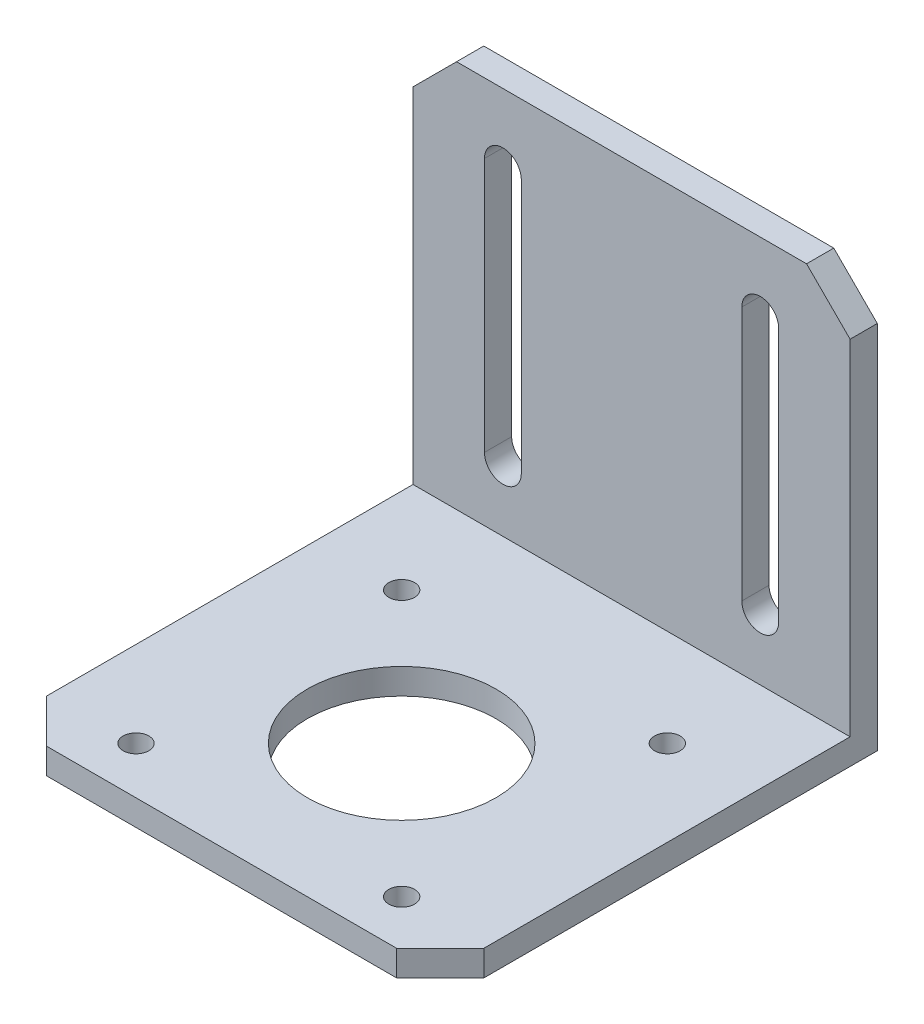
ISO-10303-21;
HEADER;
FILE_DESCRIPTION(('STEP AP214'),'2;1');
FILE_NAME('part.step','',(''),(''),'','','');
FILE_SCHEMA(('AUTOMOTIVE_DESIGN { 1 0 10303 214 1 1 1 1 }'));
ENDSEC;
DATA;
#1=APPLICATION_CONTEXT('core data for automotive mechanical design processes');
#2=APPLICATION_PROTOCOL_DEFINITION('international standard','automotive_design',2000,#1);
#3=PRODUCT_CONTEXT('',#1,'mechanical');
#4=PRODUCT('Part','Part','',(#3));
#5=PRODUCT_RELATED_PRODUCT_CATEGORY('part','',(#4));
#6=PRODUCT_DEFINITION_FORMATION('','',#4);
#7=PRODUCT_DEFINITION_CONTEXT('part definition',#1,'design');
#8=PRODUCT_DEFINITION('design','',#6,#7);
#9=PRODUCT_DEFINITION_SHAPE('','',#8);
#10=(LENGTH_UNIT() NAMED_UNIT(*) SI_UNIT(.MILLI.,.METRE.));
#11=(NAMED_UNIT(*) PLANE_ANGLE_UNIT() SI_UNIT($,.RADIAN.));
#12=(NAMED_UNIT(*) SI_UNIT($,.STERADIAN.) SOLID_ANGLE_UNIT());
#13=UNCERTAINTY_MEASURE_WITH_UNIT(LENGTH_MEASURE(1.E-05),#10,'distance_accuracy_value','');
#14=(GEOMETRIC_REPRESENTATION_CONTEXT(3) GLOBAL_UNCERTAINTY_ASSIGNED_CONTEXT((#13)) GLOBAL_UNIT_ASSIGNED_CONTEXT((#10,
#11,#12)) REPRESENTATION_CONTEXT('',''));
#15=CARTESIAN_POINT('',(0.,0.,0.));
#16=DIRECTION('',(0.,0.,1.));
#17=DIRECTION('',(1.,0.,0.));
#18=AXIS2_PLACEMENT_3D('',#15,#16,#17);
#19=CARTESIAN_POINT('',(0.,3.,0.));
#20=DIRECTION('',(0.,1.,0.));
#21=DIRECTION('',(0.,0.,1.));
#22=AXIS2_PLACEMENT_3D('',#19,#20,#21);
#23=PLANE('',#22);
#24=CARTESIAN_POINT('',(-15.5,3.,-15.5000000000001));
#25=DIRECTION('',(0.,1.,0.));
#26=DIRECTION('',(0.,0.,1.));
#27=AXIS2_PLACEMENT_3D('',#24,#25,#26);
#28=CIRCLE('',#27,1.5);
#29=CARTESIAN_POINT('',(-15.5,3.,-14.0000000000001));
#30=VERTEX_POINT('',#29);
#31=EDGE_CURVE('E267',#30,#30,#28,.T.);
#32=ORIENTED_EDGE('',*,*,#31,.F.);
#33=EDGE_LOOP('',(#32));
#34=FACE_BOUND('',#33,.T.);
#35=CARTESIAN_POINT('',(15.5,3.,15.4999999999999));
#36=DIRECTION('',(0.,1.,0.));
#37=DIRECTION('',(0.,0.,1.));
#38=AXIS2_PLACEMENT_3D('',#35,#36,#37);
#39=CIRCLE('',#38,1.5);
#40=CARTESIAN_POINT('',(15.5,3.,16.9999999999999));
#41=VERTEX_POINT('',#40);
#42=EDGE_CURVE('E279',#41,#41,#39,.T.);
#43=ORIENTED_EDGE('',*,*,#42,.F.);
#44=EDGE_LOOP('',(#43));
#45=FACE_BOUND('',#44,.T.);
#46=CARTESIAN_POINT('',(0.,3.,0.));
#47=DIRECTION('',(0.,1.,0.));
#48=DIRECTION('',(0.,0.,1.));
#49=AXIS2_PLACEMENT_3D('',#46,#47,#48);
#50=CIRCLE('',#49,11.);
#51=CARTESIAN_POINT('',(0.,3.,11.));
#52=VERTEX_POINT('',#51);
#53=EDGE_CURVE('E285',#52,#52,#50,.T.);
#54=ORIENTED_EDGE('',*,*,#53,.F.);
#55=EDGE_LOOP('',(#54));
#56=FACE_BOUND('',#55,.T.);
#57=CARTESIAN_POINT('',(-15.5,3.,15.4999999999999));
#58=DIRECTION('',(0.,1.,0.));
#59=DIRECTION('',(0.,0.,-1.));
#60=AXIS2_PLACEMENT_3D('',#57,#58,#59);
#61=CIRCLE('',#60,1.5);
#62=CARTESIAN_POINT('',(-15.5,3.,13.9999999999999));
#63=VERTEX_POINT('',#62);
#64=EDGE_CURVE('E273',#63,#63,#61,.T.);
#65=ORIENTED_EDGE('',*,*,#64,.F.);
#66=EDGE_LOOP('',(#65));
#67=FACE_BOUND('',#66,.T.);
#68=CARTESIAN_POINT('',(15.5,3.,-15.4999999999999));
#69=DIRECTION('',(0.,1.,0.));
#70=DIRECTION('',(0.,0.,-1.));
#71=AXIS2_PLACEMENT_3D('',#68,#69,#70);
#72=CIRCLE('',#71,1.5);
#73=CARTESIAN_POINT('',(15.5,3.,-16.9999999999999));
#74=VERTEX_POINT('',#73);
#75=EDGE_CURVE('E261',#74,#74,#72,.T.);
#76=ORIENTED_EDGE('',*,*,#75,.F.);
#77=EDGE_LOOP('',(#76));
#78=FACE_BOUND('',#77,.T.);
#79=DIRECTION('',(0.,0.,-1.));
#80=VECTOR('',#79,1.);
#81=CARTESIAN_POINT('',(25.5,3.,15.92));
#82=LINE('',#81,#80);
#83=CARTESIAN_POINT('',(25.5,3.,15.92));
#84=VERTEX_POINT('',#83);
#85=CARTESIAN_POINT('',(25.5,3.,-26.825));
#86=VERTEX_POINT('',#85);
#87=EDGE_CURVE('E53',#84,#86,#82,.T.);
#88=ORIENTED_EDGE('',*,*,#87,.T.);
#89=DIRECTION('',(-1.,0.,0.));
#90=VECTOR('',#89,1.);
#91=CARTESIAN_POINT('',(0.,3.,-26.825));
#92=LINE('',#91,#90);
#93=CARTESIAN_POINT('',(-25.5,3.,-26.825));
#94=VERTEX_POINT('',#93);
#95=EDGE_CURVE('E48',#86,#94,#92,.T.);
#96=ORIENTED_EDGE('',*,*,#95,.T.);
#97=DIRECTION('',(0.,0.,1.));
#98=VECTOR('',#97,1.);
#99=CARTESIAN_POINT('',(-25.5,3.,15.92));
#100=LINE('',#99,#98);
#101=CARTESIAN_POINT('',(-25.5,3.,15.92));
#102=VERTEX_POINT('',#101);
#103=EDGE_CURVE('E291',#94,#102,#100,.T.);
#104=ORIENTED_EDGE('',*,*,#103,.T.);
#105=DIRECTION('',(0.707106781186548,0.,0.707106781186548));
#106=VECTOR('',#105,1.);
#107=CARTESIAN_POINT('',(-20.42,3.,21.));
#108=LINE('',#107,#106);
#109=CARTESIAN_POINT('',(-20.42,3.,21.));
#110=VERTEX_POINT('',#109);
#111=EDGE_CURVE('E293',#102,#110,#108,.T.);
#112=ORIENTED_EDGE('',*,*,#111,.T.);
#113=DIRECTION('',(1.,0.,0.));
#114=VECTOR('',#113,1.);
#115=CARTESIAN_POINT('',(20.42,3.,21.));
#116=LINE('',#115,#114);
#117=CARTESIAN_POINT('',(20.42,3.,21.));
#118=VERTEX_POINT('',#117);
#119=EDGE_CURVE('E296',#110,#118,#116,.T.);
#120=ORIENTED_EDGE('',*,*,#119,.T.);
#121=DIRECTION('',(0.707106781186548,0.,-0.707106781186548));
#122=VECTOR('',#121,1.);
#123=CARTESIAN_POINT('',(25.5,3.,15.92));
#124=LINE('',#123,#122);
#125=EDGE_CURVE('E298',#118,#84,#124,.T.);
#126=ORIENTED_EDGE('',*,*,#125,.T.);
#127=EDGE_LOOP('',(#88,#96,#104,#112,#120,#126));
#128=FACE_BOUND('',#127,.T.);
#129=ADVANCED_FACE('F33',(#34,#45,#56,#67,#78,#128),#23,.T.);
#130=CARTESIAN_POINT('',(0.,0.,0.));
#131=DIRECTION('',(0.,1.,0.));
#132=DIRECTION('',(0.,0.,1.));
#133=AXIS2_PLACEMENT_3D('',#130,#131,#132);
#134=PLANE('',#133);
#135=DIRECTION('',(-1.,0.,0.));
#136=VECTOR('',#135,1.);
#137=CARTESIAN_POINT('',(25.5,0.,-30.));
#138=LINE('',#137,#136);
#139=CARTESIAN_POINT('',(25.5,0.,-30.));
#140=VERTEX_POINT('',#139);
#141=CARTESIAN_POINT('',(-25.5,0.,-30.));
#142=VERTEX_POINT('',#141);
#143=EDGE_CURVE('E294',#140,#142,#138,.T.);
#144=ORIENTED_EDGE('',*,*,#143,.F.);
#145=DIRECTION('',(0.,0.,-1.));
#146=VECTOR('',#145,1.);
#147=CARTESIAN_POINT('',(25.5,0.,15.92));
#148=LINE('',#147,#146);
#149=CARTESIAN_POINT('',(25.5,0.,15.92));
#150=VERTEX_POINT('',#149);
#151=EDGE_CURVE('E309',#150,#140,#148,.T.);
#152=ORIENTED_EDGE('',*,*,#151,.F.);
#153=DIRECTION('',(0.707106781186548,0.,-0.707106781186548));
#154=VECTOR('',#153,1.);
#155=CARTESIAN_POINT('',(25.5,0.,15.92));
#156=LINE('',#155,#154);
#157=CARTESIAN_POINT('',(20.42,0.,21.));
#158=VERTEX_POINT('',#157);
#159=EDGE_CURVE('E307',#158,#150,#156,.T.);
#160=ORIENTED_EDGE('',*,*,#159,.F.);
#161=DIRECTION('',(1.,0.,0.));
#162=VECTOR('',#161,1.);
#163=CARTESIAN_POINT('',(20.42,0.,21.));
#164=LINE('',#163,#162);
#165=CARTESIAN_POINT('',(-20.42,0.,21.));
#166=VERTEX_POINT('',#165);
#167=EDGE_CURVE('E305',#166,#158,#164,.T.);
#168=ORIENTED_EDGE('',*,*,#167,.F.);
#169=DIRECTION('',(0.707106781186548,0.,0.707106781186548));
#170=VECTOR('',#169,1.);
#171=CARTESIAN_POINT('',(-20.42,0.,21.));
#172=LINE('',#171,#170);
#173=CARTESIAN_POINT('',(-25.5,0.,15.92));
#174=VERTEX_POINT('',#173);
#175=EDGE_CURVE('E303',#174,#166,#172,.T.);
#176=ORIENTED_EDGE('',*,*,#175,.F.);
#177=DIRECTION('',(0.,0.,1.));
#178=VECTOR('',#177,1.);
#179=CARTESIAN_POINT('',(-25.5,0.,15.92));
#180=LINE('',#179,#178);
#181=EDGE_CURVE('E288',#142,#174,#180,.T.);
#182=ORIENTED_EDGE('',*,*,#181,.F.);
#183=EDGE_LOOP('',(#144,#152,#160,#168,#176,#182));
#184=FACE_BOUND('',#183,.T.);
#185=CARTESIAN_POINT('',(15.5,0.,-15.4999999999999));
#186=DIRECTION('',(0.,1.,0.));
#187=DIRECTION('',(0.,0.,-1.));
#188=AXIS2_PLACEMENT_3D('',#185,#186,#187);
#189=CIRCLE('',#188,1.5);
#190=CARTESIAN_POINT('',(15.5,0.,-16.9999999999999));
#191=VERTEX_POINT('',#190);
#192=EDGE_CURVE('E260',#191,#191,#189,.T.);
#193=ORIENTED_EDGE('',*,*,#192,.T.);
#194=EDGE_LOOP('',(#193));
#195=FACE_BOUND('',#194,.T.);
#196=CARTESIAN_POINT('',(-15.5,0.,-15.5000000000001));
#197=DIRECTION('',(0.,1.,0.));
#198=DIRECTION('',(0.,0.,1.));
#199=AXIS2_PLACEMENT_3D('',#196,#197,#198);
#200=CIRCLE('',#199,1.5);
#201=CARTESIAN_POINT('',(-15.5,0.,-14.0000000000001));
#202=VERTEX_POINT('',#201);
#203=EDGE_CURVE('E264',#202,#202,#200,.T.);
#204=ORIENTED_EDGE('',*,*,#203,.T.);
#205=EDGE_LOOP('',(#204));
#206=FACE_BOUND('',#205,.T.);
#207=CARTESIAN_POINT('',(-15.5,0.,15.4999999999999));
#208=DIRECTION('',(0.,1.,0.));
#209=DIRECTION('',(0.,0.,-1.));
#210=AXIS2_PLACEMENT_3D('',#207,#208,#209);
#211=CIRCLE('',#210,1.5);
#212=CARTESIAN_POINT('',(-15.5,0.,13.9999999999999));
#213=VERTEX_POINT('',#212);
#214=EDGE_CURVE('E270',#213,#213,#211,.T.);
#215=ORIENTED_EDGE('',*,*,#214,.T.);
#216=EDGE_LOOP('',(#215));
#217=FACE_BOUND('',#216,.T.);
#218=CARTESIAN_POINT('',(15.5,0.,15.4999999999999));
#219=DIRECTION('',(0.,1.,0.));
#220=DIRECTION('',(0.,0.,1.));
#221=AXIS2_PLACEMENT_3D('',#218,#219,#220);
#222=CIRCLE('',#221,1.5);
#223=CARTESIAN_POINT('',(15.5,0.,16.9999999999999));
#224=VERTEX_POINT('',#223);
#225=EDGE_CURVE('E276',#224,#224,#222,.T.);
#226=ORIENTED_EDGE('',*,*,#225,.T.);
#227=EDGE_LOOP('',(#226));
#228=FACE_BOUND('',#227,.T.);
#229=CARTESIAN_POINT('',(0.,0.,0.));
#230=DIRECTION('',(0.,1.,0.));
#231=DIRECTION('',(0.,0.,1.));
#232=AXIS2_PLACEMENT_3D('',#229,#230,#231);
#233=CIRCLE('',#232,11.);
#234=CARTESIAN_POINT('',(0.,0.,11.));
#235=VERTEX_POINT('',#234);
#236=EDGE_CURVE('E282',#235,#235,#233,.T.);
#237=ORIENTED_EDGE('',*,*,#236,.T.);
#238=EDGE_LOOP('',(#237));
#239=FACE_BOUND('',#238,.T.);
#240=ADVANCED_FACE('F335',(#184,#195,#206,#217,#228,#239),#134,.F.);
#241=CARTESIAN_POINT('',(-25.5,3.,15.92));
#242=DIRECTION('',(1.,0.,0.));
#243=DIRECTION('',(0.,0.,-1.));
#244=AXIS2_PLACEMENT_3D('',#241,#242,#243);
#245=PLANE('',#244);
#246=ORIENTED_EDGE('',*,*,#181,.T.);
#247=DIRECTION('',(0.,-1.,0.));
#248=VECTOR('',#247,1.);
#249=CARTESIAN_POINT('',(-25.5,3.,15.92));
#250=LINE('',#249,#248);
#251=EDGE_CURVE('E11',#102,#174,#250,.T.);
#252=ORIENTED_EDGE('',*,*,#251,.F.);
#253=ORIENTED_EDGE('',*,*,#103,.F.);
#254=DIRECTION('',(0.,-1.,0.));
#255=VECTOR('',#254,1.);
#256=CARTESIAN_POINT('',(-25.5,0.,-26.825));
#257=LINE('',#256,#255);
#258=CARTESIAN_POINT('',(-25.5,43.18,-26.825));
#259=VERTEX_POINT('',#258);
#260=EDGE_CURVE('E230',#259,#94,#257,.T.);
#261=ORIENTED_EDGE('',*,*,#260,.F.);
#262=DIRECTION('',(0.,0.,-1.));
#263=VECTOR('',#262,1.);
#264=CARTESIAN_POINT('',(-25.5,43.18,-26.825));
#265=LINE('',#264,#263);
#266=CARTESIAN_POINT('',(-25.5,43.18,-30.));
#267=VERTEX_POINT('',#266);
#268=EDGE_CURVE('E242',#259,#267,#265,.T.);
#269=ORIENTED_EDGE('',*,*,#268,.T.);
#270=DIRECTION('',(0.,-1.,0.));
#271=VECTOR('',#270,1.);
#272=CARTESIAN_POINT('',(-25.5,3.,-30.));
#273=LINE('',#272,#271);
#274=EDGE_CURVE('E301',#267,#142,#273,.T.);
#275=ORIENTED_EDGE('',*,*,#274,.T.);
#276=EDGE_LOOP('',(#246,#252,#253,#261,#269,#275));
#277=FACE_BOUND('',#276,.T.);
#278=ADVANCED_FACE('F35',(#277),#245,.F.);
#279=CARTESIAN_POINT('',(-20.42,3.,21.));
#280=DIRECTION('',(0.707106781186547,0.,-0.707106781186547));
#281=DIRECTION('',(-0.707106781186548,0.,-0.707106781186548));
#282=AXIS2_PLACEMENT_3D('',#279,#280,#281);
#283=PLANE('',#282);
#284=ORIENTED_EDGE('',*,*,#175,.T.);
#285=DIRECTION('',(0.,-1.,0.));
#286=VECTOR('',#285,1.);
#287=CARTESIAN_POINT('',(-20.42,3.,21.));
#288=LINE('',#287,#286);
#289=EDGE_CURVE('E41',#110,#166,#288,.T.);
#290=ORIENTED_EDGE('',*,*,#289,.F.);
#291=ORIENTED_EDGE('',*,*,#111,.F.);
#292=ORIENTED_EDGE('',*,*,#251,.T.);
#293=EDGE_LOOP('',(#284,#290,#291,#292));
#294=FACE_BOUND('',#293,.T.);
#295=ADVANCED_FACE('F356',(#294),#283,.F.);
#296=CARTESIAN_POINT('',(20.42,3.,21.));
#297=DIRECTION('',(0.,0.,-1.));
#298=DIRECTION('',(-1.,0.,0.));
#299=AXIS2_PLACEMENT_3D('',#296,#297,#298);
#300=PLANE('',#299);
#301=ORIENTED_EDGE('',*,*,#167,.T.);
#302=DIRECTION('',(0.,-1.,0.));
#303=VECTOR('',#302,1.);
#304=CARTESIAN_POINT('',(20.42,3.,21.));
#305=LINE('',#304,#303);
#306=EDGE_CURVE('E320',#118,#158,#305,.T.);
#307=ORIENTED_EDGE('',*,*,#306,.F.);
#308=ORIENTED_EDGE('',*,*,#119,.F.);
#309=ORIENTED_EDGE('',*,*,#289,.T.);
#310=EDGE_LOOP('',(#301,#307,#308,#309));
#311=FACE_BOUND('',#310,.T.);
#312=ADVANCED_FACE('F327',(#311),#300,.F.);
#313=CARTESIAN_POINT('',(25.5,3.,15.92));
#314=DIRECTION('',(-0.707106781186547,0.,-0.707106781186547));
#315=DIRECTION('',(-0.707106781186548,0.,0.707106781186548));
#316=AXIS2_PLACEMENT_3D('',#313,#314,#315);
#317=PLANE('',#316);
#318=ORIENTED_EDGE('',*,*,#159,.T.);
#319=DIRECTION('',(0.,-1.,0.));
#320=VECTOR('',#319,1.);
#321=CARTESIAN_POINT('',(25.5,3.,15.92));
#322=LINE('',#321,#320);
#323=EDGE_CURVE('E317',#84,#150,#322,.T.);
#324=ORIENTED_EDGE('',*,*,#323,.F.);
#325=ORIENTED_EDGE('',*,*,#125,.F.);
#326=ORIENTED_EDGE('',*,*,#306,.T.);
#327=EDGE_LOOP('',(#318,#324,#325,#326));
#328=FACE_BOUND('',#327,.T.);
#329=ADVANCED_FACE('F341',(#328),#317,.F.);
#330=CARTESIAN_POINT('',(25.5,3.,15.92));
#331=DIRECTION('',(-1.,0.,0.));
#332=DIRECTION('',(0.,0.,1.));
#333=AXIS2_PLACEMENT_3D('',#330,#331,#332);
#334=PLANE('',#333);
#335=DIRECTION('',(0.,-1.,0.));
#336=VECTOR('',#335,1.);
#337=CARTESIAN_POINT('',(25.5,3.,-30.));
#338=LINE('',#337,#336);
#339=CARTESIAN_POINT('',(25.5,43.18,-30.));
#340=VERTEX_POINT('',#339);
#341=EDGE_CURVE('E314',#340,#140,#338,.T.);
#342=ORIENTED_EDGE('',*,*,#341,.F.);
#343=DIRECTION('',(0.,0.,-1.));
#344=VECTOR('',#343,1.);
#345=CARTESIAN_POINT('',(25.5,43.18,-26.825));
#346=LINE('',#345,#344);
#347=CARTESIAN_POINT('',(25.5,43.18,-26.825));
#348=VERTEX_POINT('',#347);
#349=EDGE_CURVE('E256',#348,#340,#346,.T.);
#350=ORIENTED_EDGE('',*,*,#349,.F.);
#351=DIRECTION('',(0.,1.,0.));
#352=VECTOR('',#351,1.);
#353=CARTESIAN_POINT('',(25.5,0.,-26.825));
#354=LINE('',#353,#352);
#355=EDGE_CURVE('E233',#86,#348,#354,.T.);
#356=ORIENTED_EDGE('',*,*,#355,.F.);
#357=ORIENTED_EDGE('',*,*,#87,.F.);
#358=ORIENTED_EDGE('',*,*,#323,.T.);
#359=ORIENTED_EDGE('',*,*,#151,.T.);
#360=EDGE_LOOP('',(#342,#350,#356,#357,#358,#359));
#361=FACE_BOUND('',#360,.T.);
#362=ADVANCED_FACE('F344',(#361),#334,.F.);
#363=CARTESIAN_POINT('',(25.5,3.,-30.));
#364=DIRECTION('',(0.,0.,1.));
#365=DIRECTION('',(1.,0.,0.));
#366=AXIS2_PLACEMENT_3D('',#363,#364,#365);
#367=PLANE('',#366);
#368=ORIENTED_EDGE('',*,*,#143,.T.);
#369=ORIENTED_EDGE('',*,*,#274,.F.);
#370=DIRECTION('',(-0.707106781186548,-0.707106781186548,0.));
#371=VECTOR('',#370,1.);
#372=CARTESIAN_POINT('',(-25.5,43.18,-30.));
#373=LINE('',#372,#371);
#374=CARTESIAN_POINT('',(-20.42,48.26,-30.));
#375=VERTEX_POINT('',#374);
#376=EDGE_CURVE('E234',#375,#267,#373,.T.);
#377=ORIENTED_EDGE('',*,*,#376,.F.);
#378=DIRECTION('',(-1.,0.,0.));
#379=VECTOR('',#378,1.);
#380=CARTESIAN_POINT('',(-20.42,48.26,-30.));
#381=LINE('',#380,#379);
#382=CARTESIAN_POINT('',(20.42,48.26,-30.));
#383=VERTEX_POINT('',#382);
#384=EDGE_CURVE('E244',#383,#375,#381,.T.);
#385=ORIENTED_EDGE('',*,*,#384,.F.);
#386=DIRECTION('',(-0.707106781186549,0.707106781186546,0.));
#387=VECTOR('',#386,1.);
#388=CARTESIAN_POINT('',(20.42,48.26,-30.));
#389=LINE('',#388,#387);
#390=EDGE_CURVE('E229',#340,#383,#389,.T.);
#391=ORIENTED_EDGE('',*,*,#390,.F.);
#392=ORIENTED_EDGE('',*,*,#341,.T.);
#393=EDGE_LOOP('',(#368,#369,#377,#385,#391,#392));
#394=FACE_BOUND('',#393,.T.);
#395=DIRECTION('',(0.,1.,0.));
#396=VECTOR('',#395,1.);
#397=CARTESIAN_POINT('',(-12.865,40.11,-30.));
#398=LINE('',#397,#396);
#399=CARTESIAN_POINT('',(-12.865,10.41,-30.));
#400=VERTEX_POINT('',#399);
#401=CARTESIAN_POINT('',(-12.865,40.11,-30.));
#402=VERTEX_POINT('',#401);
#403=EDGE_CURVE('E202',#400,#402,#398,.T.);
#404=ORIENTED_EDGE('',*,*,#403,.T.);
#405=CARTESIAN_POINT('',(-15.015,40.11,-30.));
#406=DIRECTION('',(0.,0.,1.));
#407=DIRECTION('',(-1.,0.,0.));
#408=AXIS2_PLACEMENT_3D('',#405,#406,#407);
#409=CIRCLE('',#408,2.15);
#410=CARTESIAN_POINT('',(-17.165,40.11,-30.));
#411=VERTEX_POINT('',#410);
#412=EDGE_CURVE('E175',#402,#411,#409,.T.);
#413=ORIENTED_EDGE('',*,*,#412,.T.);
#414=DIRECTION('',(0.,-1.,0.));
#415=VECTOR('',#414,1.);
#416=CARTESIAN_POINT('',(-17.165,40.11,-30.));
#417=LINE('',#416,#415);
#418=CARTESIAN_POINT('',(-17.165,10.41,-30.));
#419=VERTEX_POINT('',#418);
#420=EDGE_CURVE('E212',#411,#419,#417,.T.);
#421=ORIENTED_EDGE('',*,*,#420,.T.);
#422=CARTESIAN_POINT('',(-15.015,10.41,-30.));
#423=DIRECTION('',(0.,0.,1.));
#424=DIRECTION('',(1.,0.,0.));
#425=AXIS2_PLACEMENT_3D('',#422,#423,#424);
#426=CIRCLE('',#425,2.15000000000001);
#427=EDGE_CURVE('E215',#419,#400,#426,.T.);
#428=ORIENTED_EDGE('',*,*,#427,.T.);
#429=EDGE_LOOP('',(#404,#413,#421,#428));
#430=FACE_BOUND('',#429,.T.);
#431=DIRECTION('',(0.,1.,0.));
#432=VECTOR('',#431,1.);
#433=CARTESIAN_POINT('',(17.165,40.11,-30.));
#434=LINE('',#433,#432);
#435=CARTESIAN_POINT('',(17.165,10.41,-30.));
#436=VERTEX_POINT('',#435);
#437=CARTESIAN_POINT('',(17.165,40.11,-30.));
#438=VERTEX_POINT('',#437);
#439=EDGE_CURVE('E168',#436,#438,#434,.T.);
#440=ORIENTED_EDGE('',*,*,#439,.T.);
#441=CARTESIAN_POINT('',(15.015,40.11,-30.));
#442=DIRECTION('',(0.,0.,1.));
#443=DIRECTION('',(1.,0.,0.));
#444=AXIS2_PLACEMENT_3D('',#441,#442,#443);
#445=CIRCLE('',#444,2.15);
#446=CARTESIAN_POINT('',(12.865,40.11,-30.));
#447=VERTEX_POINT('',#446);
#448=EDGE_CURVE('E187',#438,#447,#445,.T.);
#449=ORIENTED_EDGE('',*,*,#448,.T.);
#450=DIRECTION('',(0.,-1.,0.));
#451=VECTOR('',#450,1.);
#452=CARTESIAN_POINT('',(12.865,40.11,-30.));
#453=LINE('',#452,#451);
#454=CARTESIAN_POINT('',(12.865,10.41,-30.));
#455=VERTEX_POINT('',#454);
#456=EDGE_CURVE('E174',#447,#455,#453,.T.);
#457=ORIENTED_EDGE('',*,*,#456,.T.);
#458=CARTESIAN_POINT('',(15.015,10.41,-30.));
#459=DIRECTION('',(0.,0.,1.));
#460=DIRECTION('',(-1.,0.,0.));
#461=AXIS2_PLACEMENT_3D('',#458,#459,#460);
#462=CIRCLE('',#461,2.15000000000001);
#463=EDGE_CURVE('E190',#455,#436,#462,.T.);
#464=ORIENTED_EDGE('',*,*,#463,.T.);
#465=EDGE_LOOP('',(#440,#449,#457,#464));
#466=FACE_BOUND('',#465,.T.);
#467=ADVANCED_FACE('F376',(#394,#430,#466),#367,.F.);
#468=CARTESIAN_POINT('',(0.,3.,0.));
#469=DIRECTION('',(0.,-1.,0.));
#470=DIRECTION('',(0.,0.,-1.));
#471=AXIS2_PLACEMENT_3D('',#468,#469,#470);
#472=CYLINDRICAL_SURFACE('',#471,11.);
#473=ORIENTED_EDGE('',*,*,#53,.T.);
#474=EDGE_LOOP('',(#473));
#475=FACE_BOUND('',#474,.T.);
#476=ORIENTED_EDGE('',*,*,#236,.F.);
#477=EDGE_LOOP('',(#476));
#478=FACE_BOUND('',#477,.T.);
#479=ADVANCED_FACE('F373',(#475,#478),#472,.F.);
#480=CARTESIAN_POINT('',(15.5,3.,15.4999999999999));
#481=DIRECTION('',(0.,-1.,0.));
#482=DIRECTION('',(0.,0.,-1.));
#483=AXIS2_PLACEMENT_3D('',#480,#481,#482);
#484=CYLINDRICAL_SURFACE('',#483,1.5);
#485=ORIENTED_EDGE('',*,*,#42,.T.);
#486=EDGE_LOOP('',(#485));
#487=FACE_BOUND('',#486,.T.);
#488=ORIENTED_EDGE('',*,*,#225,.F.);
#489=EDGE_LOOP('',(#488));
#490=FACE_BOUND('',#489,.T.);
#491=ADVANCED_FACE('F403',(#487,#490),#484,.F.);
#492=CARTESIAN_POINT('',(-15.5,3.,15.4999999999999));
#493=DIRECTION('',(0.,-1.,0.));
#494=DIRECTION('',(0.,0.,-1.));
#495=AXIS2_PLACEMENT_3D('',#492,#493,#494);
#496=CYLINDRICAL_SURFACE('',#495,1.5);
#497=ORIENTED_EDGE('',*,*,#64,.T.);
#498=EDGE_LOOP('',(#497));
#499=FACE_BOUND('',#498,.T.);
#500=ORIENTED_EDGE('',*,*,#214,.F.);
#501=EDGE_LOOP('',(#500));
#502=FACE_BOUND('',#501,.T.);
#503=ADVANCED_FACE('F410',(#499,#502),#496,.F.);
#504=CARTESIAN_POINT('',(-15.5,3.,-15.5000000000001));
#505=DIRECTION('',(0.,-1.,0.));
#506=DIRECTION('',(0.,0.,-1.));
#507=AXIS2_PLACEMENT_3D('',#504,#505,#506);
#508=CYLINDRICAL_SURFACE('',#507,1.5);
#509=ORIENTED_EDGE('',*,*,#31,.T.);
#510=EDGE_LOOP('',(#509));
#511=FACE_BOUND('',#510,.T.);
#512=ORIENTED_EDGE('',*,*,#203,.F.);
#513=EDGE_LOOP('',(#512));
#514=FACE_BOUND('',#513,.T.);
#515=ADVANCED_FACE('F417',(#511,#514),#508,.F.);
#516=CARTESIAN_POINT('',(15.5,3.,-15.4999999999999));
#517=DIRECTION('',(0.,-1.,0.));
#518=DIRECTION('',(0.,0.,-1.));
#519=AXIS2_PLACEMENT_3D('',#516,#517,#518);
#520=CYLINDRICAL_SURFACE('',#519,1.5);
#521=ORIENTED_EDGE('',*,*,#75,.T.);
#522=EDGE_LOOP('',(#521));
#523=FACE_BOUND('',#522,.T.);
#524=ORIENTED_EDGE('',*,*,#192,.F.);
#525=EDGE_LOOP('',(#524));
#526=FACE_BOUND('',#525,.T.);
#527=ADVANCED_FACE('F425',(#523,#526),#520,.F.);
#528=CARTESIAN_POINT('',(0.,0.,-26.825));
#529=DIRECTION('',(0.,0.,-1.));
#530=DIRECTION('',(-1.,0.,0.));
#531=AXIS2_PLACEMENT_3D('',#528,#529,#530);
#532=PLANE('',#531);
#533=ORIENTED_EDGE('',*,*,#95,.F.);
#534=ORIENTED_EDGE('',*,*,#355,.T.);
#535=DIRECTION('',(-0.707106781186549,0.707106781186546,0.));
#536=VECTOR('',#535,1.);
#537=CARTESIAN_POINT('',(20.42,48.26,-26.825));
#538=LINE('',#537,#536);
#539=CARTESIAN_POINT('',(20.42,48.26,-26.825));
#540=VERTEX_POINT('',#539);
#541=EDGE_CURVE('E236',#348,#540,#538,.T.);
#542=ORIENTED_EDGE('',*,*,#541,.T.);
#543=DIRECTION('',(-1.,0.,0.));
#544=VECTOR('',#543,1.);
#545=CARTESIAN_POINT('',(-20.42,48.26,-26.825));
#546=LINE('',#545,#544);
#547=CARTESIAN_POINT('',(-20.42,48.26,-26.825));
#548=VERTEX_POINT('',#547);
#549=EDGE_CURVE('E238',#540,#548,#546,.T.);
#550=ORIENTED_EDGE('',*,*,#549,.T.);
#551=DIRECTION('',(-0.707106781186548,-0.707106781186548,0.));
#552=VECTOR('',#551,1.);
#553=CARTESIAN_POINT('',(-25.5,43.18,-26.825));
#554=LINE('',#553,#552);
#555=EDGE_CURVE('E240',#548,#259,#554,.T.);
#556=ORIENTED_EDGE('',*,*,#555,.T.);
#557=ORIENTED_EDGE('',*,*,#260,.T.);
#558=EDGE_LOOP('',(#533,#534,#542,#550,#556,#557));
#559=FACE_BOUND('',#558,.T.);
#560=CARTESIAN_POINT('',(-15.015,40.11,-26.825));
#561=DIRECTION('',(0.,0.,1.));
#562=DIRECTION('',(-1.,0.,0.));
#563=AXIS2_PLACEMENT_3D('',#560,#561,#562);
#564=CIRCLE('',#563,2.15);
#565=CARTESIAN_POINT('',(-12.865,40.11,-26.825));
#566=VERTEX_POINT('',#565);
#567=CARTESIAN_POINT('',(-17.165,40.11,-26.825));
#568=VERTEX_POINT('',#567);
#569=EDGE_CURVE('E199',#566,#568,#564,.T.);
#570=ORIENTED_EDGE('',*,*,#569,.F.);
#571=DIRECTION('',(0.,1.,0.));
#572=VECTOR('',#571,1.);
#573=CARTESIAN_POINT('',(-12.865,40.11,-26.825));
#574=LINE('',#573,#572);
#575=CARTESIAN_POINT('',(-12.865,10.41,-26.825));
#576=VERTEX_POINT('',#575);
#577=EDGE_CURVE('E207',#576,#566,#574,.T.);
#578=ORIENTED_EDGE('',*,*,#577,.F.);
#579=CARTESIAN_POINT('',(-15.015,10.41,-26.825));
#580=DIRECTION('',(0.,0.,1.));
#581=DIRECTION('',(1.,0.,0.));
#582=AXIS2_PLACEMENT_3D('',#579,#580,#581);
#583=CIRCLE('',#582,2.15000000000001);
#584=CARTESIAN_POINT('',(-17.165,10.41,-26.825));
#585=VERTEX_POINT('',#584);
#586=EDGE_CURVE('E204',#585,#576,#583,.T.);
#587=ORIENTED_EDGE('',*,*,#586,.F.);
#588=DIRECTION('',(0.,-1.,0.));
#589=VECTOR('',#588,1.);
#590=CARTESIAN_POINT('',(-17.165,40.11,-26.825));
#591=LINE('',#590,#589);
#592=EDGE_CURVE('E201',#568,#585,#591,.T.);
#593=ORIENTED_EDGE('',*,*,#592,.F.);
#594=EDGE_LOOP('',(#570,#578,#587,#593));
#595=FACE_BOUND('',#594,.T.);
#596=CARTESIAN_POINT('',(15.015,40.11,-26.825));
#597=DIRECTION('',(0.,0.,1.));
#598=DIRECTION('',(1.,0.,0.));
#599=AXIS2_PLACEMENT_3D('',#596,#597,#598);
#600=CIRCLE('',#599,2.15);
#601=CARTESIAN_POINT('',(17.165,40.11,-26.825));
#602=VERTEX_POINT('',#601);
#603=CARTESIAN_POINT('',(12.865,40.11,-26.825));
#604=VERTEX_POINT('',#603);
#605=EDGE_CURVE('E157',#602,#604,#600,.T.);
#606=ORIENTED_EDGE('',*,*,#605,.F.);
#607=DIRECTION('',(0.,1.,0.));
#608=VECTOR('',#607,1.);
#609=CARTESIAN_POINT('',(17.165,40.11,-26.825));
#610=LINE('',#609,#608);
#611=CARTESIAN_POINT('',(17.165,10.41,-26.825));
#612=VERTEX_POINT('',#611);
#613=EDGE_CURVE('E183',#612,#602,#610,.T.);
#614=ORIENTED_EDGE('',*,*,#613,.F.);
#615=CARTESIAN_POINT('',(15.015,10.41,-26.825));
#616=DIRECTION('',(0.,0.,1.));
#617=DIRECTION('',(-1.,0.,0.));
#618=AXIS2_PLACEMENT_3D('',#615,#616,#617);
#619=CIRCLE('',#618,2.15000000000001);
#620=CARTESIAN_POINT('',(12.865,10.41,-26.825));
#621=VERTEX_POINT('',#620);
#622=EDGE_CURVE('E181',#621,#612,#619,.T.);
#623=ORIENTED_EDGE('',*,*,#622,.F.);
#624=DIRECTION('',(0.,-1.,0.));
#625=VECTOR('',#624,1.);
#626=CARTESIAN_POINT('',(12.865,40.11,-26.825));
#627=LINE('',#626,#625);
#628=EDGE_CURVE('E167',#604,#621,#627,.T.);
#629=ORIENTED_EDGE('',*,*,#628,.F.);
#630=EDGE_LOOP('',(#606,#614,#623,#629));
#631=FACE_BOUND('',#630,.T.);
#632=ADVANCED_FACE('F179',(#559,#595,#631),#532,.F.);
#633=CARTESIAN_POINT('',(20.42,48.26,-26.825));
#634=DIRECTION('',(-0.707106781186546,-0.707106781186549,0.));
#635=DIRECTION('',(0.707106781186549,-0.707106781186546,0.));
#636=AXIS2_PLACEMENT_3D('',#633,#634,#635);
#637=PLANE('',#636);
#638=ORIENTED_EDGE('',*,*,#390,.T.);
#639=DIRECTION('',(0.,0.,-1.));
#640=VECTOR('',#639,1.);
#641=CARTESIAN_POINT('',(20.42,48.26,-26.825));
#642=LINE('',#641,#640);
#643=EDGE_CURVE('E253',#540,#383,#642,.T.);
#644=ORIENTED_EDGE('',*,*,#643,.F.);
#645=ORIENTED_EDGE('',*,*,#541,.F.);
#646=ORIENTED_EDGE('',*,*,#349,.T.);
#647=EDGE_LOOP('',(#638,#644,#645,#646));
#648=FACE_BOUND('',#647,.T.);
#649=ADVANCED_FACE('F439',(#648),#637,.F.);
#650=CARTESIAN_POINT('',(-20.42,48.26,-26.825));
#651=DIRECTION('',(0.,-1.,0.));
#652=DIRECTION('',(0.,0.,-1.));
#653=AXIS2_PLACEMENT_3D('',#650,#651,#652);
#654=PLANE('',#653);
#655=ORIENTED_EDGE('',*,*,#384,.T.);
#656=DIRECTION('',(0.,0.,-1.));
#657=VECTOR('',#656,1.);
#658=CARTESIAN_POINT('',(-20.42,48.26,-26.825));
#659=LINE('',#658,#657);
#660=EDGE_CURVE('E250',#548,#375,#659,.T.);
#661=ORIENTED_EDGE('',*,*,#660,.F.);
#662=ORIENTED_EDGE('',*,*,#549,.F.);
#663=ORIENTED_EDGE('',*,*,#643,.T.);
#664=EDGE_LOOP('',(#655,#661,#662,#663));
#665=FACE_BOUND('',#664,.T.);
#666=ADVANCED_FACE('F446',(#665),#654,.F.);
#667=CARTESIAN_POINT('',(-25.5,43.18,-26.825));
#668=DIRECTION('',(0.707106781186548,-0.707106781186548,0.));
#669=DIRECTION('',(0.707106781186548,0.707106781186548,0.));
#670=AXIS2_PLACEMENT_3D('',#667,#668,#669);
#671=PLANE('',#670);
#672=ORIENTED_EDGE('',*,*,#376,.T.);
#673=ORIENTED_EDGE('',*,*,#268,.F.);
#674=ORIENTED_EDGE('',*,*,#555,.F.);
#675=ORIENTED_EDGE('',*,*,#660,.T.);
#676=EDGE_LOOP('',(#672,#673,#674,#675));
#677=FACE_BOUND('',#676,.T.);
#678=ADVANCED_FACE('F454',(#677),#671,.F.);
#679=CARTESIAN_POINT('',(-15.015,40.11,-26.825));
#680=DIRECTION('',(0.,0.,-1.));
#681=DIRECTION('',(-1.,0.,0.));
#682=AXIS2_PLACEMENT_3D('',#679,#680,#681);
#683=CYLINDRICAL_SURFACE('',#682,2.15);
#684=ORIENTED_EDGE('',*,*,#412,.F.);
#685=DIRECTION('',(0.,0.,-1.));
#686=VECTOR('',#685,1.);
#687=CARTESIAN_POINT('',(-12.865,40.11,-26.825));
#688=LINE('',#687,#686);
#689=EDGE_CURVE('E209',#566,#402,#688,.T.);
#690=ORIENTED_EDGE('',*,*,#689,.F.);
#691=ORIENTED_EDGE('',*,*,#569,.T.);
#692=DIRECTION('',(0.,0.,-1.));
#693=VECTOR('',#692,1.);
#694=CARTESIAN_POINT('',(-17.165,40.11,-26.825));
#695=LINE('',#694,#693);
#696=EDGE_CURVE('E226',#568,#411,#695,.T.);
#697=ORIENTED_EDGE('',*,*,#696,.T.);
#698=EDGE_LOOP('',(#684,#690,#691,#697));
#699=FACE_BOUND('',#698,.T.);
#700=ADVANCED_FACE('F462',(#699),#683,.F.);
#701=CARTESIAN_POINT('',(-17.165,40.11,-26.825));
#702=DIRECTION('',(1.,0.,0.));
#703=DIRECTION('',(0.,1.,0.));
#704=AXIS2_PLACEMENT_3D('',#701,#702,#703);
#705=PLANE('',#704);
#706=ORIENTED_EDGE('',*,*,#420,.F.);
#707=ORIENTED_EDGE('',*,*,#696,.F.);
#708=ORIENTED_EDGE('',*,*,#592,.T.);
#709=DIRECTION('',(0.,0.,-1.));
#710=VECTOR('',#709,1.);
#711=CARTESIAN_POINT('',(-17.165,10.41,-26.825));
#712=LINE('',#711,#710);
#713=EDGE_CURVE('E224',#585,#419,#712,.T.);
#714=ORIENTED_EDGE('',*,*,#713,.T.);
#715=EDGE_LOOP('',(#706,#707,#708,#714));
#716=FACE_BOUND('',#715,.T.);
#717=ADVANCED_FACE('F470',(#716),#705,.T.);
#718=CARTESIAN_POINT('',(-15.015,10.41,-26.825));
#719=DIRECTION('',(0.,0.,-1.));
#720=DIRECTION('',(-1.,0.,0.));
#721=AXIS2_PLACEMENT_3D('',#718,#719,#720);
#722=CYLINDRICAL_SURFACE('',#721,2.15000000000001);
#723=ORIENTED_EDGE('',*,*,#427,.F.);
#724=ORIENTED_EDGE('',*,*,#713,.F.);
#725=ORIENTED_EDGE('',*,*,#586,.T.);
#726=DIRECTION('',(0.,0.,-1.));
#727=VECTOR('',#726,1.);
#728=CARTESIAN_POINT('',(-12.865,10.41,-26.825));
#729=LINE('',#728,#727);
#730=EDGE_CURVE('E222',#576,#400,#729,.T.);
#731=ORIENTED_EDGE('',*,*,#730,.T.);
#732=EDGE_LOOP('',(#723,#724,#725,#731));
#733=FACE_BOUND('',#732,.T.);
#734=ADVANCED_FACE('F478',(#733),#722,.F.);
#735=CARTESIAN_POINT('',(-12.865,40.11,-26.825));
#736=DIRECTION('',(-1.,0.,0.));
#737=DIRECTION('',(0.,-1.,0.));
#738=AXIS2_PLACEMENT_3D('',#735,#736,#737);
#739=PLANE('',#738);
#740=ORIENTED_EDGE('',*,*,#403,.F.);
#741=ORIENTED_EDGE('',*,*,#730,.F.);
#742=ORIENTED_EDGE('',*,*,#577,.T.);
#743=ORIENTED_EDGE('',*,*,#689,.T.);
#744=EDGE_LOOP('',(#740,#741,#742,#743));
#745=FACE_BOUND('',#744,.T.);
#746=ADVANCED_FACE('F486',(#745),#739,.T.);
#747=CARTESIAN_POINT('',(15.015,40.11,-26.825));
#748=DIRECTION('',(0.,0.,-1.));
#749=DIRECTION('',(-1.,0.,0.));
#750=AXIS2_PLACEMENT_3D('',#747,#748,#749);
#751=CYLINDRICAL_SURFACE('',#750,2.15);
#752=ORIENTED_EDGE('',*,*,#448,.F.);
#753=DIRECTION('',(0.,0.,-1.));
#754=VECTOR('',#753,1.);
#755=CARTESIAN_POINT('',(17.165,40.11,-26.825));
#756=LINE('',#755,#754);
#757=EDGE_CURVE('E163',#602,#438,#756,.T.);
#758=ORIENTED_EDGE('',*,*,#757,.F.);
#759=ORIENTED_EDGE('',*,*,#605,.T.);
#760=DIRECTION('',(0.,0.,-1.));
#761=VECTOR('',#760,1.);
#762=CARTESIAN_POINT('',(12.865,40.11,-26.825));
#763=LINE('',#762,#761);
#764=EDGE_CURVE('E160',#604,#447,#763,.T.);
#765=ORIENTED_EDGE('',*,*,#764,.T.);
#766=EDGE_LOOP('',(#752,#758,#759,#765));
#767=FACE_BOUND('',#766,.T.);
#768=ADVANCED_FACE('F159',(#767),#751,.F.);
#769=CARTESIAN_POINT('',(12.865,40.11,-26.825));
#770=DIRECTION('',(1.,0.,0.));
#771=DIRECTION('',(0.,1.,0.));
#772=AXIS2_PLACEMENT_3D('',#769,#770,#771);
#773=PLANE('',#772);
#774=ORIENTED_EDGE('',*,*,#456,.F.);
#775=ORIENTED_EDGE('',*,*,#764,.F.);
#776=ORIENTED_EDGE('',*,*,#628,.T.);
#777=DIRECTION('',(0.,0.,-1.));
#778=VECTOR('',#777,1.);
#779=CARTESIAN_POINT('',(12.865,10.41,-26.825));
#780=LINE('',#779,#778);
#781=EDGE_CURVE('E176',#621,#455,#780,.T.);
#782=ORIENTED_EDGE('',*,*,#781,.T.);
#783=EDGE_LOOP('',(#774,#775,#776,#782));
#784=FACE_BOUND('',#783,.T.);
#785=ADVANCED_FACE('F171',(#784),#773,.T.);
#786=CARTESIAN_POINT('',(15.015,10.41,-26.825));
#787=DIRECTION('',(0.,0.,-1.));
#788=DIRECTION('',(-1.,0.,0.));
#789=AXIS2_PLACEMENT_3D('',#786,#787,#788);
#790=CYLINDRICAL_SURFACE('',#789,2.15000000000001);
#791=ORIENTED_EDGE('',*,*,#463,.F.);
#792=ORIENTED_EDGE('',*,*,#781,.F.);
#793=ORIENTED_EDGE('',*,*,#622,.T.);
#794=DIRECTION('',(0.,0.,-1.));
#795=VECTOR('',#794,1.);
#796=CARTESIAN_POINT('',(17.165,10.41,-26.825));
#797=LINE('',#796,#795);
#798=EDGE_CURVE('E196',#612,#436,#797,.T.);
#799=ORIENTED_EDGE('',*,*,#798,.T.);
#800=EDGE_LOOP('',(#791,#792,#793,#799));
#801=FACE_BOUND('',#800,.T.);
#802=ADVANCED_FACE('F507',(#801),#790,.F.);
#803=CARTESIAN_POINT('',(17.165,40.11,-26.825));
#804=DIRECTION('',(-1.,0.,0.));
#805=DIRECTION('',(0.,-1.,0.));
#806=AXIS2_PLACEMENT_3D('',#803,#804,#805);
#807=PLANE('',#806);
#808=ORIENTED_EDGE('',*,*,#439,.F.);
#809=ORIENTED_EDGE('',*,*,#798,.F.);
#810=ORIENTED_EDGE('',*,*,#613,.T.);
#811=ORIENTED_EDGE('',*,*,#757,.T.);
#812=EDGE_LOOP('',(#808,#809,#810,#811));
#813=FACE_BOUND('',#812,.T.);
#814=ADVANCED_FACE('F514',(#813),#807,.T.);
#815=CLOSED_SHELL('',(#129,#240,#278,#295,#312,#329,#362,#467,#479,#491,#503,#515,#527,#632,
#649,#666,#678,#700,#717,#734,#746,#768,#785,#802,#814));
#816=MANIFOLD_SOLID_BREP('B2',#815);
#817=ADVANCED_BREP_SHAPE_REPRESENTATION('',(#18,#816),#14);
#818=SHAPE_DEFINITION_REPRESENTATION(#9,#817);
ENDSEC;
END-ISO-10303-21;
